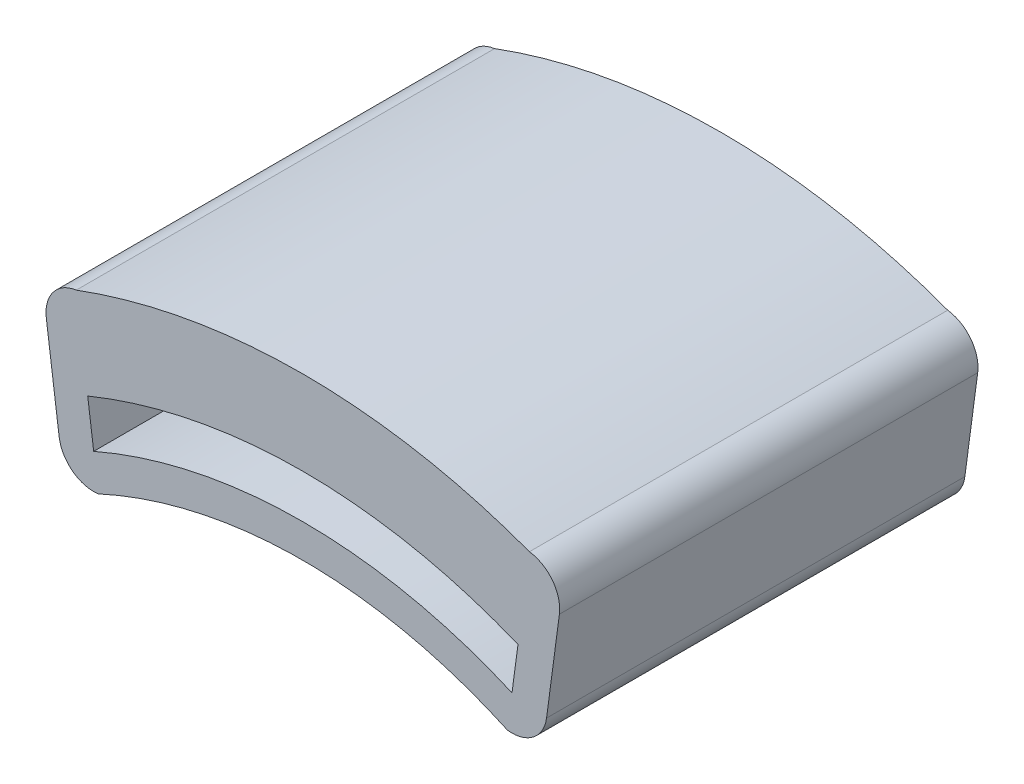
ISO-10303-21;
HEADER;
FILE_DESCRIPTION(('STEP AP214'),'2;1');
FILE_NAME('part.step','',(''),(''),'','','');
FILE_SCHEMA(('AUTOMOTIVE_DESIGN { 1 0 10303 214 1 1 1 1 }'));
ENDSEC;
DATA;
#1=APPLICATION_CONTEXT('core data for automotive mechanical design processes');
#2=APPLICATION_PROTOCOL_DEFINITION('international standard','automotive_design',2000,#1);
#3=PRODUCT_CONTEXT('',#1,'mechanical');
#4=PRODUCT('Part','Part','',(#3));
#5=PRODUCT_RELATED_PRODUCT_CATEGORY('part','',(#4));
#6=PRODUCT_DEFINITION_FORMATION('','',#4);
#7=PRODUCT_DEFINITION_CONTEXT('part definition',#1,'design');
#8=PRODUCT_DEFINITION('design','',#6,#7);
#9=PRODUCT_DEFINITION_SHAPE('','',#8);
#10=(LENGTH_UNIT() NAMED_UNIT(*) SI_UNIT(.MILLI.,.METRE.));
#11=(NAMED_UNIT(*) PLANE_ANGLE_UNIT() SI_UNIT($,.RADIAN.));
#12=(NAMED_UNIT(*) SI_UNIT($,.STERADIAN.) SOLID_ANGLE_UNIT());
#13=UNCERTAINTY_MEASURE_WITH_UNIT(LENGTH_MEASURE(1.E-05),#10,'distance_accuracy_value','');
#14=(GEOMETRIC_REPRESENTATION_CONTEXT(3) GLOBAL_UNCERTAINTY_ASSIGNED_CONTEXT((#13)) GLOBAL_UNIT_ASSIGNED_CONTEXT((#10,
#11,#12)) REPRESENTATION_CONTEXT('',''));
#15=CARTESIAN_POINT('',(0.,0.,0.));
#16=DIRECTION('',(0.,0.,1.));
#17=DIRECTION('',(1.,0.,0.));
#18=AXIS2_PLACEMENT_3D('',#15,#16,#17);
#19=CARTESIAN_POINT('',(-8.19446630907337,-1.09088193411879,0.));
#20=DIRECTION('',(-0.991255034978405,-0.131960053159888,0.));
#21=DIRECTION('',(0.131960053159888,-0.991255034978405,0.));
#22=AXIS2_PLACEMENT_3D('',#19,#20,#21);
#23=PLANE('',#22);
#24=DIRECTION('',(0.,0.,-1.));
#25=VECTOR('',#24,1.);
#26=CARTESIAN_POINT('',(-12.3430961382157,30.0727172606789,24.));
#27=LINE('',#26,#25);
#28=CARTESIAN_POINT('',(-12.3430961382157,30.0727172606789,24.));
#29=VERTEX_POINT('',#28);
#30=CARTESIAN_POINT('',(-12.3430961382157,30.0727172606789,0.));
#31=VERTEX_POINT('',#30);
#32=EDGE_CURVE('E321',#29,#31,#27,.T.);
#33=ORIENTED_EDGE('',*,*,#32,.F.);
#34=DIRECTION('',(-0.131960053159888,0.991255034978405,0.));
#35=VECTOR('',#34,1.);
#36=CARTESIAN_POINT('',(-11.7360798936802,25.5129440997782,24.));
#37=LINE('',#36,#35);
#38=CARTESIAN_POINT('',(-12.,27.495454169735,24.));
#39=VERTEX_POINT('',#38);
#40=EDGE_CURVE('E313',#39,#29,#37,.T.);
#41=ORIENTED_EDGE('',*,*,#40,.F.);
#42=DIRECTION('',(0.,0.,-1.));
#43=VECTOR('',#42,1.);
#44=CARTESIAN_POINT('',(-12.,27.495454169735,24.));
#45=LINE('',#44,#43);
#46=CARTESIAN_POINT('',(-12.,27.495454169735,0.));
#47=VERTEX_POINT('',#46);
#48=EDGE_CURVE('E297',#39,#47,#45,.T.);
#49=ORIENTED_EDGE('',*,*,#48,.T.);
#50=DIRECTION('',(0.131960053159888,-0.991255034978405,0.));
#51=VECTOR('',#50,1.);
#52=CARTESIAN_POINT('',(-13.,35.0072352825947,0.));
#53=LINE('',#52,#51);
#54=EDGE_CURVE('E320',#31,#47,#53,.T.);
#55=ORIENTED_EDGE('',*,*,#54,.F.);
#56=EDGE_LOOP('',(#33,#41,#49,#55));
#57=FACE_BOUND('',#56,.T.);
#58=ADVANCED_FACE('F39',(#57),#23,.F.);
#59=CARTESIAN_POINT('',(0.,0.,24.));
#60=DIRECTION('',(0.,0.,-1.));
#61=DIRECTION('',(-1.,0.,0.));
#62=AXIS2_PLACEMENT_3D('',#59,#60,#61);
#63=CYLINDRICAL_SURFACE('',#62,30.);
#64=CARTESIAN_POINT('',(0.,0.,0.));
#65=DIRECTION('',(0.,0.,1.));
#66=DIRECTION('',(-1.,0.,0.));
#67=AXIS2_PLACEMENT_3D('',#64,#65,#66);
#68=CIRCLE('',#67,30.);
#69=CARTESIAN_POINT('',(12.,27.495454169735,0.));
#70=VERTEX_POINT('',#69);
#71=EDGE_CURVE('E278',#70,#47,#68,.T.);
#72=ORIENTED_EDGE('',*,*,#71,.T.);
#73=ORIENTED_EDGE('',*,*,#48,.F.);
#74=CARTESIAN_POINT('',(0.,0.,24.));
#75=DIRECTION('',(0.,0.,1.));
#76=DIRECTION('',(-1.,0.,0.));
#77=AXIS2_PLACEMENT_3D('',#74,#75,#76);
#78=CIRCLE('',#77,30.);
#79=CARTESIAN_POINT('',(12.,27.495454169735,24.));
#80=VERTEX_POINT('',#79);
#81=EDGE_CURVE('E277',#80,#39,#78,.T.);
#82=ORIENTED_EDGE('',*,*,#81,.F.);
#83=DIRECTION('',(0.,0.,-1.));
#84=VECTOR('',#83,1.);
#85=CARTESIAN_POINT('',(12.,27.495454169735,24.));
#86=LINE('',#85,#84);
#87=EDGE_CURVE('E289',#80,#70,#86,.T.);
#88=ORIENTED_EDGE('',*,*,#87,.T.);
#89=EDGE_LOOP('',(#72,#73,#82,#88));
#90=FACE_BOUND('',#89,.T.);
#91=ADVANCED_FACE('F235',(#90),#63,.T.);
#92=CARTESIAN_POINT('',(0.,0.,24.));
#93=DIRECTION('',(0.,0.,-1.));
#94=DIRECTION('',(-1.,0.,0.));
#95=AXIS2_PLACEMENT_3D('',#92,#93,#94);
#96=CYLINDRICAL_SURFACE('',#95,28.082839740832);
#97=CARTESIAN_POINT('',(0.,0.,0.));
#98=DIRECTION('',(0.,0.,-1.));
#99=DIRECTION('',(-1.,0.,0.));
#100=AXIS2_PLACEMENT_3D('',#97,#98,#99);
#101=CIRCLE('',#100,28.082839740832);
#102=CARTESIAN_POINT('',(-11.7360798936802,25.5129440997782,0.));
#103=VERTEX_POINT('',#102);
#104=CARTESIAN_POINT('',(11.7360798936802,25.5129440997782,0.));
#105=VERTEX_POINT('',#104);
#106=EDGE_CURVE('E271',#103,#105,#101,.T.);
#107=ORIENTED_EDGE('',*,*,#106,.T.);
#108=DIRECTION('',(0.,0.,-1.));
#109=VECTOR('',#108,1.);
#110=CARTESIAN_POINT('',(11.7360798936802,25.5129440997782,24.));
#111=LINE('',#110,#109);
#112=CARTESIAN_POINT('',(11.7360798936802,25.5129440997782,24.));
#113=VERTEX_POINT('',#112);
#114=EDGE_CURVE('E268',#113,#105,#111,.T.);
#115=ORIENTED_EDGE('',*,*,#114,.F.);
#116=CARTESIAN_POINT('',(0.,0.,24.));
#117=DIRECTION('',(0.,0.,-1.));
#118=DIRECTION('',(-1.,0.,0.));
#119=AXIS2_PLACEMENT_3D('',#116,#117,#118);
#120=CIRCLE('',#119,28.082839740832);
#121=CARTESIAN_POINT('',(-11.7360798936802,25.5129440997782,24.));
#122=VERTEX_POINT('',#121);
#123=EDGE_CURVE('E282',#122,#113,#120,.T.);
#124=ORIENTED_EDGE('',*,*,#123,.F.);
#125=DIRECTION('',(0.,0.,-1.));
#126=VECTOR('',#125,1.);
#127=CARTESIAN_POINT('',(-11.7360798936802,25.5129440997782,24.));
#128=LINE('',#127,#126);
#129=EDGE_CURVE('E275',#122,#103,#128,.T.);
#130=ORIENTED_EDGE('',*,*,#129,.T.);
#131=EDGE_LOOP('',(#107,#115,#124,#130));
#132=FACE_BOUND('',#131,.T.);
#133=ADVANCED_FACE('F241',(#132),#96,.F.);
#134=CARTESIAN_POINT('',(0.,0.,24.));
#135=DIRECTION('',(0.,0.,-1.));
#136=DIRECTION('',(-1.,0.,0.));
#137=AXIS2_PLACEMENT_3D('',#134,#135,#136);
#138=PLANE('',#137);
#139=DIRECTION('',(-0.131960053159888,-0.991255034978405,0.));
#140=VECTOR('',#139,1.);
#141=CARTESIAN_POINT('',(13.,35.0072352825947,24.));
#142=LINE('',#141,#140);
#143=CARTESIAN_POINT('',(12.3430961382157,30.0727172606789,24.));
#144=VERTEX_POINT('',#143);
#145=EDGE_CURVE('E195',#144,#80,#142,.T.);
#146=ORIENTED_EDGE('',*,*,#145,.T.);
#147=ORIENTED_EDGE('',*,*,#81,.T.);
#148=ORIENTED_EDGE('',*,*,#40,.T.);
#149=CARTESIAN_POINT('',(0.,0.,24.));
#150=DIRECTION('',(0.,0.,-1.));
#151=DIRECTION('',(-1.,0.,0.));
#152=AXIS2_PLACEMENT_3D('',#149,#150,#151);
#153=CIRCLE('',#152,32.5072352825947);
#154=EDGE_CURVE('E152',#29,#144,#153,.T.);
#155=ORIENTED_EDGE('',*,*,#154,.T.);
#156=EDGE_LOOP('',(#146,#147,#148,#155));
#157=FACE_BOUND('',#156,.T.);
#158=CARTESIAN_POINT('',(0.,0.,24.));
#159=DIRECTION('',(0.,0.,1.));
#160=DIRECTION('',(-1.,0.,0.));
#161=AXIS2_PLACEMENT_3D('',#158,#159,#160);
#162=CIRCLE('',#161,37.343092026919);
#163=CARTESIAN_POINT('',(13.,35.0072352825947,24.));
#164=VERTEX_POINT('',#163);
#165=CARTESIAN_POINT('',(-13.,35.0072352825947,24.));
#166=VERTEX_POINT('',#165);
#167=EDGE_CURVE('E149',#164,#166,#162,.T.);
#168=ORIENTED_EDGE('',*,*,#167,.T.);
#169=CARTESIAN_POINT('',(-12.7360798936802,33.0247252126379,24.));
#170=DIRECTION('',(0.,0.,-1.));
#171=DIRECTION('',(-1.,0.,0.));
#172=AXIS2_PLACEMENT_3D('',#169,#170,#171);
#173=CIRCLE('',#172,2.);
#174=CARTESIAN_POINT('',(-14.718589963637,32.7608051063181,24.));
#175=VERTEX_POINT('',#174);
#176=EDGE_CURVE('E178',#166,#175,#173,.F.);
#177=ORIENTED_EDGE('',*,*,#176,.T.);
#178=DIRECTION('',(-0.131960053159888,0.991255034978405,0.));
#179=VECTOR('',#178,1.);
#180=CARTESIAN_POINT('',(-13.718589963637,25.2490239934585,24.));
#181=LINE('',#180,#179);
#182=CARTESIAN_POINT('',(-13.9825100699568,27.2315340634153,24.));
#183=VERTEX_POINT('',#182);
#184=EDGE_CURVE('E285',#183,#175,#181,.T.);
#185=ORIENTED_EDGE('',*,*,#184,.F.);
#186=CARTESIAN_POINT('',(-12.,27.495454169735,24.));
#187=DIRECTION('',(0.,0.,-1.));
#188=DIRECTION('',(-1.,0.,0.));
#189=AXIS2_PLACEMENT_3D('',#186,#187,#188);
#190=CIRCLE('',#189,2.);
#191=EDGE_CURVE('E175',#183,#122,#190,.F.);
#192=ORIENTED_EDGE('',*,*,#191,.T.);
#193=ORIENTED_EDGE('',*,*,#123,.T.);
#194=CARTESIAN_POINT('',(12.,27.4954541697351,24.));
#195=DIRECTION('',(0.,0.,-1.));
#196=DIRECTION('',(-1.,0.,0.));
#197=AXIS2_PLACEMENT_3D('',#194,#195,#196);
#198=CIRCLE('',#197,2.);
#199=CARTESIAN_POINT('',(13.9825100699568,27.2315340634153,24.));
#200=VERTEX_POINT('',#199);
#201=EDGE_CURVE('E55',#113,#200,#198,.F.);
#202=ORIENTED_EDGE('',*,*,#201,.T.);
#203=DIRECTION('',(-0.131960053159888,-0.991255034978405,0.));
#204=VECTOR('',#203,1.);
#205=CARTESIAN_POINT('',(14.9825100699568,34.7433151762749,24.));
#206=LINE('',#205,#204);
#207=CARTESIAN_POINT('',(14.718589963637,32.7608051063181,24.));
#208=VERTEX_POINT('',#207);
#209=EDGE_CURVE('E183',#208,#200,#206,.T.);
#210=ORIENTED_EDGE('',*,*,#209,.F.);
#211=CARTESIAN_POINT('',(12.7360798936802,33.0247252126379,24.));
#212=DIRECTION('',(0.,0.,-1.));
#213=DIRECTION('',(-1.,0.,0.));
#214=AXIS2_PLACEMENT_3D('',#211,#212,#213);
#215=CIRCLE('',#214,2.);
#216=EDGE_CURVE('E63',#208,#164,#215,.F.);
#217=ORIENTED_EDGE('',*,*,#216,.T.);
#218=EDGE_LOOP('',(#168,#177,#185,#192,#193,#202,#210,#217));
#219=FACE_BOUND('',#218,.T.);
#220=ADVANCED_FACE('F186',(#157,#219),#138,.F.);
#221=CARTESIAN_POINT('',(0.,0.,0.));
#222=DIRECTION('',(0.,0.,-1.));
#223=DIRECTION('',(-1.,0.,0.));
#224=AXIS2_PLACEMENT_3D('',#221,#222,#223);
#225=PLANE('',#224);
#226=ORIENTED_EDGE('',*,*,#71,.F.);
#227=DIRECTION('',(0.131960053159888,0.991255034978405,0.));
#228=VECTOR('',#227,1.);
#229=CARTESIAN_POINT('',(11.7360798936802,25.5129440997782,0.));
#230=LINE('',#229,#228);
#231=CARTESIAN_POINT('',(12.3430961382157,30.0727172606789,0.));
#232=VERTEX_POINT('',#231);
#233=EDGE_CURVE('E188',#70,#232,#230,.T.);
#234=ORIENTED_EDGE('',*,*,#233,.T.);
#235=CARTESIAN_POINT('',(0.,0.,0.));
#236=DIRECTION('',(0.,0.,-1.));
#237=DIRECTION('',(-1.,0.,0.));
#238=AXIS2_PLACEMENT_3D('',#235,#236,#237);
#239=CIRCLE('',#238,32.5072352825947);
#240=EDGE_CURVE('E143',#31,#232,#239,.T.);
#241=ORIENTED_EDGE('',*,*,#240,.F.);
#242=ORIENTED_EDGE('',*,*,#54,.T.);
#243=EDGE_LOOP('',(#226,#234,#241,#242));
#244=FACE_BOUND('',#243,.T.);
#245=DIRECTION('',(0.131960053159888,-0.991255034978405,0.));
#246=VECTOR('',#245,1.);
#247=CARTESIAN_POINT('',(-14.9825100699568,34.7433151762749,0.));
#248=LINE('',#247,#246);
#249=CARTESIAN_POINT('',(-14.718589963637,32.7608051063181,0.));
#250=VERTEX_POINT('',#249);
#251=CARTESIAN_POINT('',(-13.9825100699568,27.2315340634153,0.));
#252=VERTEX_POINT('',#251);
#253=EDGE_CURVE('E308',#250,#252,#248,.T.);
#254=ORIENTED_EDGE('',*,*,#253,.F.);
#255=CARTESIAN_POINT('',(-12.7360798936802,33.0247252126379,0.));
#256=DIRECTION('',(0.,0.,-1.));
#257=DIRECTION('',(-1.,0.,0.));
#258=AXIS2_PLACEMENT_3D('',#255,#256,#257);
#259=CIRCLE('',#258,2.);
#260=CARTESIAN_POINT('',(-13.,35.0072352825947,0.));
#261=VERTEX_POINT('',#260);
#262=EDGE_CURVE('E138',#250,#261,#259,.T.);
#263=ORIENTED_EDGE('',*,*,#262,.T.);
#264=CARTESIAN_POINT('',(0.,0.,0.));
#265=DIRECTION('',(0.,0.,1.));
#266=DIRECTION('',(-1.,0.,0.));
#267=AXIS2_PLACEMENT_3D('',#264,#265,#266);
#268=CIRCLE('',#267,37.343092026919);
#269=CARTESIAN_POINT('',(13.,35.0072352825947,0.));
#270=VERTEX_POINT('',#269);
#271=EDGE_CURVE('E130',#270,#261,#268,.T.);
#272=ORIENTED_EDGE('',*,*,#271,.F.);
#273=CARTESIAN_POINT('',(12.7360798936802,33.0247252126379,0.));
#274=DIRECTION('',(0.,0.,-1.));
#275=DIRECTION('',(-1.,0.,0.));
#276=AXIS2_PLACEMENT_3D('',#273,#274,#275);
#277=CIRCLE('',#276,2.);
#278=CARTESIAN_POINT('',(14.718589963637,32.7608051063181,0.));
#279=VERTEX_POINT('',#278);
#280=EDGE_CURVE('E136',#270,#279,#277,.T.);
#281=ORIENTED_EDGE('',*,*,#280,.T.);
#282=DIRECTION('',(0.131960053159888,0.991255034978405,0.));
#283=VECTOR('',#282,1.);
#284=CARTESIAN_POINT('',(13.718589963637,25.2490239934585,0.));
#285=LINE('',#284,#283);
#286=CARTESIAN_POINT('',(13.9825100699568,27.2315340634153,0.));
#287=VERTEX_POINT('',#286);
#288=EDGE_CURVE('E185',#287,#279,#285,.T.);
#289=ORIENTED_EDGE('',*,*,#288,.F.);
#290=CARTESIAN_POINT('',(12.,27.4954541697351,0.));
#291=DIRECTION('',(0.,0.,-1.));
#292=DIRECTION('',(-1.,0.,0.));
#293=AXIS2_PLACEMENT_3D('',#290,#291,#292);
#294=CIRCLE('',#293,2.);
#295=EDGE_CURVE('E155',#287,#105,#294,.T.);
#296=ORIENTED_EDGE('',*,*,#295,.T.);
#297=ORIENTED_EDGE('',*,*,#106,.F.);
#298=CARTESIAN_POINT('',(-12.,27.495454169735,0.));
#299=DIRECTION('',(0.,0.,-1.));
#300=DIRECTION('',(-1.,0.,0.));
#301=AXIS2_PLACEMENT_3D('',#298,#299,#300);
#302=CIRCLE('',#301,2.);
#303=EDGE_CURVE('E160',#103,#252,#302,.T.);
#304=ORIENTED_EDGE('',*,*,#303,.T.);
#305=EDGE_LOOP('',(#254,#263,#272,#281,#289,#296,#297,#304));
#306=FACE_BOUND('',#305,.T.);
#307=ADVANCED_FACE('F133',(#244,#306),#225,.T.);
#308=CARTESIAN_POINT('',(-10.1769763790302,-1.35480204043857,0.));
#309=DIRECTION('',(-0.991255034978405,-0.131960053159888,0.));
#310=DIRECTION('',(0.131960053159888,-0.991255034978405,0.));
#311=AXIS2_PLACEMENT_3D('',#308,#309,#310);
#312=PLANE('',#311);
#313=ORIENTED_EDGE('',*,*,#184,.T.);
#314=DIRECTION('',(0.,0.,-1.));
#315=VECTOR('',#314,1.);
#316=CARTESIAN_POINT('',(-14.718589963637,32.7608051063181,0.));
#317=LINE('',#316,#315);
#318=EDGE_CURVE('E156',#175,#250,#317,.T.);
#319=ORIENTED_EDGE('',*,*,#318,.T.);
#320=ORIENTED_EDGE('',*,*,#253,.T.);
#321=DIRECTION('',(0.,0.,1.));
#322=VECTOR('',#321,1.);
#323=CARTESIAN_POINT('',(-13.9825100699568,27.2315340634153,24.));
#324=LINE('',#323,#322);
#325=EDGE_CURVE('E163',#252,#183,#324,.T.);
#326=ORIENTED_EDGE('',*,*,#325,.T.);
#327=EDGE_LOOP('',(#313,#319,#320,#326));
#328=FACE_BOUND('',#327,.T.);
#329=ADVANCED_FACE('F247',(#328),#312,.T.);
#330=CARTESIAN_POINT('',(0.,0.,24.));
#331=DIRECTION('',(0.,0.,-1.));
#332=DIRECTION('',(-1.,0.,0.));
#333=AXIS2_PLACEMENT_3D('',#330,#331,#332);
#334=CYLINDRICAL_SURFACE('',#333,37.343092026919);
#335=ORIENTED_EDGE('',*,*,#271,.T.);
#336=DIRECTION('',(0.,0.,-1.));
#337=VECTOR('',#336,1.);
#338=CARTESIAN_POINT('',(-13.,35.0072352825947,24.));
#339=LINE('',#338,#337);
#340=EDGE_CURVE('E317',#166,#261,#339,.T.);
#341=ORIENTED_EDGE('',*,*,#340,.F.);
#342=ORIENTED_EDGE('',*,*,#167,.F.);
#343=DIRECTION('',(0.,0.,-1.));
#344=VECTOR('',#343,1.);
#345=CARTESIAN_POINT('',(13.,35.0072352825947,24.));
#346=LINE('',#345,#344);
#347=EDGE_CURVE('E147',#164,#270,#346,.T.);
#348=ORIENTED_EDGE('',*,*,#347,.T.);
#349=EDGE_LOOP('',(#335,#341,#342,#348));
#350=FACE_BOUND('',#349,.T.);
#351=ADVANCED_FACE('F148',(#350),#334,.T.);
#352=CARTESIAN_POINT('',(0.,0.,24.));
#353=DIRECTION('',(0.,0.,-1.));
#354=DIRECTION('',(-1.,0.,0.));
#355=AXIS2_PLACEMENT_3D('',#352,#353,#354);
#356=CYLINDRICAL_SURFACE('',#355,32.5072352825947);
#357=CARTESIAN_POINT('',(0.,32.5072352825947,22.));
#358=CARTESIAN_POINT('',(-0.27397744995883,32.5072350180725,21.9999995969007));
#359=CARTESIAN_POINT('',(-0.547961887279076,32.5037633996525,21.9887312299823));
#360=CARTESIAN_POINT('',(-1.09391315629798,32.4899719077899,21.9437609960717));
#361=CARTESIAN_POINT('',(-1.36587991924894,32.4796518020744,21.9100583682003));
#362=CARTESIAN_POINT('',(-1.90586900600679,32.4524438200971,21.8205183840396));
#363=CARTESIAN_POINT('',(-2.17389046175007,32.4355545202239,21.7646762298385));
#364=CARTESIAN_POINT('',(-2.70402423656154,32.3956673645125,21.6313529564662));
#365=CARTESIAN_POINT('',(-2.96613658053511,32.3726695344252,21.5538719285158));
#366=CARTESIAN_POINT('',(-3.4822101009548,32.3212266855569,21.3780805669376));
#367=CARTESIAN_POINT('',(-3.73618464966118,32.2927912013809,21.279806660757));
#368=CARTESIAN_POINT('',(-4.23488920395653,32.2311839125901,21.0630933725675));
#369=CARTESIAN_POINT('',(-4.47961575158893,32.1980103580766,20.9446465370211));
#370=CARTESIAN_POINT('',(-4.95816554000693,32.1277983596085,20.6885121219913));
#371=CARTESIAN_POINT('',(-5.19198985786533,32.0907602986189,20.5508264485806));
#372=CARTESIAN_POINT('',(-5.64735808003023,32.0137630921472,20.2571638025444));
#373=CARTESIAN_POINT('',(-5.86890131002041,31.9738037865474,20.1011858270076));
#374=CARTESIAN_POINT('',(-6.30420229962093,31.8908731998445,19.7675129844213));
#375=CARTESIAN_POINT('',(-6.51758746084267,31.8478496875291,19.5893448736591));
#376=CARTESIAN_POINT('',(-6.92870118770224,31.7609445507939,19.2159690905943));
#377=CARTESIAN_POINT('',(-7.126429523447,31.7170629137858,19.0207611681805));
#378=CARTESIAN_POINT('',(-7.50503430732088,31.6296153657719,18.6144970314819));
#379=CARTESIAN_POINT('',(-7.68590757159231,31.5860495158446,18.4034378364962));
#380=CARTESIAN_POINT('',(-8.02959161596786,31.5004345212629,17.9668121725298));
#381=CARTESIAN_POINT('',(-8.19240286559572,31.4583853372018,17.741246080898));
#382=CARTESIAN_POINT('',(-8.50256654818438,31.375995333507,17.2713848945545));
#383=CARTESIAN_POINT('',(-8.64945148961618,31.3357201676075,17.0267693166972));
#384=CARTESIAN_POINT('',(-8.92195911330177,31.259223017118,16.5254832677826));
#385=CARTESIAN_POINT('',(-9.04759010508046,31.222999450385,16.2688175582627));
#386=CARTESIAN_POINT('',(-9.27663500257236,31.1557161269344,15.7450937342347));
#387=CARTESIAN_POINT('',(-9.38004874100772,31.1246564090967,15.4780355414975));
#388=CARTESIAN_POINT('',(-9.56374198950005,31.0687047770751,14.9354496856926));
#389=CARTESIAN_POINT('',(-9.64402237057474,31.0438126306746,14.659922341938));
#390=CARTESIAN_POINT('',(-9.77869255700877,31.0016507968128,14.1106347842155));
#391=CARTESIAN_POINT('',(-9.83377151794006,30.9841792917825,13.8370589791854));
#392=CARTESIAN_POINT('',(-9.92090154283603,30.9563912184857,13.2859031182593));
#393=CARTESIAN_POINT('',(-9.95295301944206,30.9460745220087,13.008323134207));
#394=CARTESIAN_POINT('',(-9.99371051469418,30.9329364326511,12.4513391073177));
#395=CARTESIAN_POINT('',(-10.0024217245029,30.9301133730948,12.1719354839408));
#396=CARTESIAN_POINT('',(-9.99642632282075,30.9320516363852,11.6134094898792));
#397=CARTESIAN_POINT('',(-9.98172024916009,30.9368127850436,11.3342871128824));
#398=CARTESIAN_POINT('',(-9.93004724324291,30.9534360456238,10.7891126303869));
#399=CARTESIAN_POINT('',(-9.89395275959056,30.9650197538618,10.5229687675618));
#400=CARTESIAN_POINT('',(-9.8005668707572,30.9947032878417,9.99480543131999));
#401=CARTESIAN_POINT('',(-9.74327608572013,31.0128029229455,9.73278583747272));
#402=CARTESIAN_POINT('',(-9.60799875924452,31.0549789348614,9.21467402169991));
#403=CARTESIAN_POINT('',(-9.53001443166504,31.0790546723138,8.95858116889781));
#404=CARTESIAN_POINT('',(-9.35395084711621,31.1324976168412,8.45386576773879));
#405=CARTESIAN_POINT('',(-9.25586398927233,31.161866824898,8.20524608592005));
#406=CARTESIAN_POINT('',(-9.03886666102879,31.2255054191794,7.71373639387521));
#407=CARTESIAN_POINT('',(-8.91968619623307,31.2598371300662,7.47097371115236));
#408=CARTESIAN_POINT('',(-8.6622858143179,31.3321403358639,6.99622710752354));
#409=CARTESIAN_POINT('',(-8.52405937394578,31.3701130764678,6.76424691618621));
#410=CARTESIAN_POINT('',(-8.22953319477405,31.4486621341391,6.31251473422599));
#411=CARTESIAN_POINT('',(-8.07323273749678,31.4892385546793,6.09276323023213));
#412=CARTESIAN_POINT('',(-7.74355944346192,31.5719259444184,5.66676761598674));
#413=CARTESIAN_POINT('',(-7.57018609648898,31.614036959454,5.46052390971632));
#414=CARTESIAN_POINT('',(-7.19938560649112,31.7005837970392,5.05393223039627));
#415=CARTESIAN_POINT('',(-7.00123351605941,31.7450400294341,4.85424910023052));
#416=CARTESIAN_POINT('',(-6.5887956820222,31.8331990880538,4.47226779581909));
#417=CARTESIAN_POINT('',(-6.37451514041252,31.8769021516606,4.28996405873889));
#418=CARTESIAN_POINT('',(-5.931013129865,31.9623910530744,3.94380703251064));
#419=CARTESIAN_POINT('',(-5.70178499951618,32.0041760217492,3.77996205948677));
#420=CARTESIAN_POINT('',(-5.23002697485567,32.0846441409514,3.4720384489165));
#421=CARTESIAN_POINT('',(-4.98750236265044,32.1233285083894,3.32795204067289));
#422=CARTESIAN_POINT('',(-4.488760575479,32.196822510178,3.05953975476768));
#423=CARTESIAN_POINT('',(-4.23245335892769,32.2316004682447,2.93537234958215));
#424=CARTESIAN_POINT('',(-3.70961784949692,32.2959509171305,2.70915149423311));
#425=CARTESIAN_POINT('',(-3.44308945349515,32.3255233554138,2.60709826725048));
#426=CARTESIAN_POINT('',(-2.90179731204585,32.3786016669048,2.42602502772172));
#427=CARTESIAN_POINT('',(-2.62703554855457,32.4021089872349,2.34699952023513));
#428=CARTESIAN_POINT('',(-2.07128666652377,32.4423753675399,2.21268750996012));
#429=CARTESIAN_POINT('',(-1.79029978856965,32.4591346878303,2.15740009143007));
#430=CARTESIAN_POINT('',(-1.23492655978379,32.4849143150488,2.07272078025122));
#431=CARTESIAN_POINT('',(-0.960688735577882,32.494201673545,2.04243418986602));
#432=CARTESIAN_POINT('',(-0.41050348330445,32.5058076708483,2.00462537772779));
#433=CARTESIAN_POINT('',(-0.134556098257496,32.5081264843088,1.99710258544369));
#434=CARTESIAN_POINT('',(0.416948833734831,32.505730786395,2.00489115534064));
#435=CARTESIAN_POINT('',(0.692506425799943,32.5010171695586,2.02019961334493));
#436=CARTESIAN_POINT('',(1.24120976951545,32.4846899093669,2.07350134147842));
#437=CARTESIAN_POINT('',(1.51435553970158,32.4730763190873,2.11149443711367));
#438=CARTESIAN_POINT('',(2.0496670546716,32.4436331494726,2.20862276300325));
#439=CARTESIAN_POINT('',(2.31193856964161,32.4259607419402,2.26722429493803));
#440=CARTESIAN_POINT('',(2.83058486306329,32.3848086997791,2.40521888187112));
#441=CARTESIAN_POINT('',(3.08695749553726,32.3613269871593,2.48461937726733));
#442=CARTESIAN_POINT('',(3.59195247136743,32.3091728142476,2.66353292388505));
#443=CARTESIAN_POINT('',(3.84057699354874,32.2805018289415,2.76304026092202));
#444=CARTESIAN_POINT('',(4.3286802282,32.2186812614955,2.98146093848693));
#445=CARTESIAN_POINT('',(4.56815538861795,32.1855299621794,3.10038172328587));
#446=CARTESIAN_POINT('',(5.04191491677247,32.1147652366554,3.35976115113182));
#447=CARTESIAN_POINT('',(5.27594538113561,32.0770653166445,3.50065993928643));
#448=CARTESIAN_POINT('',(5.73147625747664,31.9988119833426,3.80093687691972));
#449=CARTESIAN_POINT('',(5.95297098566036,31.9582572940832,3.96032331052434));
#450=CARTESIAN_POINT('',(6.38199984111779,31.8753535828795,4.29647197431158));
#451=CARTESIAN_POINT('',(6.58953383298848,31.8330045435386,4.47323437298008));
#452=CARTESIAN_POINT('',(6.9894116190885,31.747602745842,4.84302494524222));
#453=CARTESIAN_POINT('',(7.1817550984352,31.7045499729211,5.03605345584313));
#454=CARTESIAN_POINT('',(7.5572045445547,31.6172038338502,5.44495329154905));
#455=CARTESIAN_POINT('',(7.73966814744127,31.5729266595741,5.66141848440263));
#456=CARTESIAN_POINT('',(8.08567587718123,31.48609227804,6.1091707974974));
#457=CARTESIAN_POINT('',(8.24922685331866,31.4435344517691,6.34045250442463));
#458=CARTESIAN_POINT('',(8.55639535003831,31.3613415157725,6.81652843406243));
#459=CARTESIAN_POINT('',(8.70000484781821,31.3217075853693,7.06132804021863));
#460=CARTESIAN_POINT('',(8.96606986159293,31.2465846019324,7.56264911541091));
#461=CARTESIAN_POINT('',(9.08853413134298,31.2110938356815,7.81916567794801));
#462=CARTESIAN_POINT('',(9.31093493081572,31.1454689402774,8.34122083929368));
#463=CARTESIAN_POINT('',(9.41095992678767,31.1153138783404,8.60671908388138));
#464=CARTESIAN_POINT('',(9.58823446162039,31.0611446527316,9.14583242961715));
#465=CARTESIAN_POINT('',(9.6654839741066,31.0371304961711,9.41944754016436));
#466=CARTESIAN_POINT('',(9.7964658496504,30.9960371798768,9.972677779878));
#467=CARTESIAN_POINT('',(9.85020541114554,30.9789558975041,10.2522910449422));
#468=CARTESIAN_POINT('',(9.93367032999031,30.9522934322052,10.8154298653373));
#469=CARTESIAN_POINT('',(9.96339666442312,30.9427119441175,11.0989552610084));
#470=CARTESIAN_POINT('',(9.99776508812133,30.9316236547947,11.6551808162468));
#471=CARTESIAN_POINT('',(10.0034501814278,30.9297811317636,11.9278103569876));
#472=CARTESIAN_POINT('',(9.99254178356689,30.9333071213415,12.4725711313101));
#473=CARTESIAN_POINT('',(9.97594897663189,30.9386754124813,12.7447023799391));
#474=CARTESIAN_POINT('',(9.92064341935737,30.9564535873053,13.2864576402734));
#475=CARTESIAN_POINT('',(9.88193175095954,30.9688631265674,13.5560817739584));
#476=CARTESIAN_POINT('',(9.78274549985666,31.0003377033422,14.0908989802067));
#477=CARTESIAN_POINT('',(9.72227082106255,31.0194027702405,14.3560920332003));
#478=CARTESIAN_POINT('',(9.58108778898903,31.0632979652809,14.8765326078324));
#479=CARTESIAN_POINT('',(9.50067410748342,31.088043775859,15.1318673369248));
#480=CARTESIAN_POINT('',(9.31982733680036,31.142737259441,15.6348693504586));
#481=CARTESIAN_POINT('',(9.21938709691607,31.1726867899988,15.8825338595641));
#482=CARTESIAN_POINT('',(8.99927233061051,31.2369425290935,16.3685538666246));
#483=CARTESIAN_POINT('',(8.8795987418669,31.2712485252239,16.6069098176932));
#484=CARTESIAN_POINT('',(8.62185281300239,31.3432911309305,17.0729245545161));
#485=CARTESIAN_POINT('',(8.48377934160923,31.3810279513971,17.3005826813757));
#486=CARTESIAN_POINT('',(8.18455316064591,31.4604241903264,17.7523261574449));
#487=CARTESIAN_POINT('',(8.02272205127987,31.5021782397031,17.97594572918));
#488=CARTESIAN_POINT('',(7.68129157454202,31.5871658598604,18.4088819256651));
#489=CARTESIAN_POINT('',(7.50169181099137,31.6303994636158,18.6181982313263));
#490=CARTESIAN_POINT('',(7.12581213493906,31.7171933176559,19.0213079296744));
#491=CARTESIAN_POINT('',(6.92952792156879,31.7607536495089,19.2150972947104));
#492=CARTESIAN_POINT('',(6.5215289496786,31.8470324456141,19.5858847350889));
#493=CARTESIAN_POINT('',(6.30981444751214,31.8897509238374,19.762883089279));
#494=CARTESIAN_POINT('',(5.86532223284273,31.9745386142698,20.1042566105523));
#495=CARTESIAN_POINT('',(5.63209065804269,32.0165447943648,20.2680571487426));
#496=CARTESIAN_POINT('',(5.15217469443143,32.0972680987723,20.5753279272718));
#497=CARTESIAN_POINT('',(4.90549511976739,32.1359863875609,20.7188053775897));
#498=CARTESIAN_POINT('',(4.40030120789909,32.209048679334,20.9843625512673));
#499=CARTESIAN_POINT('',(4.14178879623016,32.2433933906067,21.1064457405727));
#500=CARTESIAN_POINT('',(3.61470670984883,32.3067279132386,21.3282166503388));
#501=CARTESIAN_POINT('',(3.34613791176877,32.3357181900521,21.4279063176031));
#502=CARTESIAN_POINT('',(2.82640612124731,32.3850801234232,21.5957740632068));
#503=CARTESIAN_POINT('',(2.5759636197935,32.406004184453,21.6660269781131));
#504=CARTESIAN_POINT('',(2.06998933043209,32.442253340783,21.7868679526125));
#505=CARTESIAN_POINT('',(1.81445791548015,32.4575788448088,21.8374574477609));
#506=CARTESIAN_POINT('',(1.29998241292798,32.482252109083,21.9185609123008));
#507=CARTESIAN_POINT('',(1.04103886691335,32.4916008066001,21.9490780294164));
#508=CARTESIAN_POINT('',(0.521399046249018,32.5040926710438,21.989798262087));
#509=CARTESIAN_POINT('',(0.260702686455137,32.5072355343003,22.0000003835683));
#510=CARTESIAN_POINT('',(0.,32.5072352825947,22.));
#511=B_SPLINE_CURVE_WITH_KNOTS('',3,(#357,#358,#359,#360,#361,#362,#363,#364,#365,#366,#367,
#368,#369,#370,#371,#372,#373,#374,#375,#376,#377,#378,#379,#380,#381,#382,#383,#384,#385,#386,
#387,#388,#389,#390,#391,#392,#393,#394,#395,#396,#397,#398,#399,#400,#401,#402,#403,#404,#405,
#406,#407,#408,#409,#410,#411,#412,#413,#414,#415,#416,#417,#418,#419,#420,#421,#422,#423,#424,
#425,#426,#427,#428,#429,#430,#431,#432,#433,#434,#435,#436,#437,#438,#439,#440,#441,#442,#443,
#444,#445,#446,#447,#448,#449,#450,#451,#452,#453,#454,#455,#456,#457,#458,#459,#460,#461,#462,
#463,#464,#465,#466,#467,#468,#469,#470,#471,#472,#473,#474,#475,#476,#477,#478,#479,#480,#481,
#482,#483,#484,#485,#486,#487,#488,#489,#490,#491,#492,#493,#494,#495,#496,#497,#498,#499,#500,
#501,#502,#503,#504,#505,#506,#507,#508,#509,#510),.UNSPECIFIED.,.T.,.F.,(4,2,2,2,2,2,2,2,2,2,2,
2,2,2,2,2,2,2,2,2,2,2,2,2,2,2,2,2,2,2,2,2,2,2,2,2,2,2,2,2,2,2,2,2,2,2,2,2,2,2,2,2,2,2,2,2,2,2,2,
2,2,2,2,2,2,2,2,2,2,2,2,2,2,2,2,2,4),(0.,0.821691912132715,1.64341169414782,2.46530965052819,
3.28720414217287,4.10767049005699,4.92844064590756,5.74912954218507,6.56986345539444,
7.41279397317529,8.25573686562111,9.09883866530979,9.9419185433512,10.805330088811,
11.6684032875819,12.5314829843648,13.3945301802031,14.2323112086736,15.0700772241392,
15.9076568946571,16.7452173285648,17.5507606003158,18.3562803060086,19.1617138694365,
19.9674525353271,20.7843686007464,21.6015651588996,22.4187942133953,23.2360476978164,
24.0894686632834,24.9426155402089,25.7961452564353,26.6493383257282,27.5090144967704,
28.3686993434394,29.2281788813403,30.0876252602147,30.9147885123911,31.7419310331307,
32.5689683488036,33.3959993028513,34.2030230036603,35.0103357956578,35.8174194784488,
36.6248133752633,37.4511648029058,38.2778879511513,39.1046191165013,39.9313674145836,
40.7900011358915,41.6483229191702,42.5069890258379,43.3652988029738,44.2201628040059,
45.0750277949869,45.9296308540515,46.7841991381011,47.6012863010883,48.4183483690433,
49.2353704739178,50.0523961861906,50.8580004078362,51.6638927962744,52.469745907196,
53.2756485869246,54.1122247046103,54.9488194792223,55.7856305666102,56.622427754678,
57.4856323207726,58.3485298784573,59.2112875142082,60.0739701161959,60.8559908896586,
61.6379545598694,62.4197955743005,63.2016748456188),.UNSPECIFIED.);
#512=CARTESIAN_POINT('',(0.,32.5072352825947,22.));
#513=VERTEX_POINT('',#512);
#514=EDGE_CURVE('E144',#513,#513,#511,.T.);
#515=ORIENTED_EDGE('',*,*,#514,.F.);
#516=EDGE_LOOP('',(#515));
#517=FACE_BOUND('',#516,.T.);
#518=ORIENTED_EDGE('',*,*,#240,.T.);
#519=DIRECTION('',(0.,0.,-1.));
#520=VECTOR('',#519,1.);
#521=CARTESIAN_POINT('',(12.3430961382157,30.0727172606789,24.));
#522=LINE('',#521,#520);
#523=EDGE_CURVE('E151',#144,#232,#522,.T.);
#524=ORIENTED_EDGE('',*,*,#523,.F.);
#525=ORIENTED_EDGE('',*,*,#154,.F.);
#526=ORIENTED_EDGE('',*,*,#32,.T.);
#527=EDGE_LOOP('',(#518,#524,#525,#526));
#528=FACE_BOUND('',#527,.T.);
#529=ADVANCED_FACE('F341',(#517,#528),#356,.F.);
#530=CARTESIAN_POINT('',(0.,25.5119440997782,12.));
#531=DIRECTION('',(0.,1.,0.));
#532=DIRECTION('',(0.,0.,1.));
#533=AXIS2_PLACEMENT_3D('',#530,#531,#532);
#534=CYLINDRICAL_SURFACE('',#533,10.);
#535=ORIENTED_EDGE('',*,*,#514,.T.);
#536=EDGE_LOOP('',(#535));
#537=FACE_BOUND('',#536,.T.);
#538=CARTESIAN_POINT('',(0.,35.01,12.));
#539=DIRECTION('',(0.,1.,0.));
#540=DIRECTION('',(0.,0.,1.));
#541=AXIS2_PLACEMENT_3D('',#538,#539,#540);
#542=CIRCLE('',#541,10.);
#543=CARTESIAN_POINT('',(0.,35.01,22.));
#544=VERTEX_POINT('',#543);
#545=EDGE_CURVE('E192',#544,#544,#542,.T.);
#546=ORIENTED_EDGE('',*,*,#545,.T.);
#547=EDGE_LOOP('',(#546));
#548=FACE_BOUND('',#547,.T.);
#549=ADVANCED_FACE('F213',(#537,#548),#534,.F.);
#550=CARTESIAN_POINT('',(0.,35.01,12.));
#551=DIRECTION('',(0.,1.,0.));
#552=DIRECTION('',(0.,0.,1.));
#553=AXIS2_PLACEMENT_3D('',#550,#551,#552);
#554=PLANE('',#553);
#555=ORIENTED_EDGE('',*,*,#545,.F.);
#556=EDGE_LOOP('',(#555));
#557=FACE_BOUND('',#556,.T.);
#558=ADVANCED_FACE('F218',(#557),#554,.F.);
#559=CARTESIAN_POINT('',(8.19446630907337,-1.09088193411879,0.));
#560=DIRECTION('',(0.991255034978405,-0.131960053159888,0.));
#561=DIRECTION('',(0.131960053159888,0.991255034978405,0.));
#562=AXIS2_PLACEMENT_3D('',#559,#560,#561);
#563=PLANE('',#562);
#564=ORIENTED_EDGE('',*,*,#233,.F.);
#565=ORIENTED_EDGE('',*,*,#87,.F.);
#566=ORIENTED_EDGE('',*,*,#145,.F.);
#567=ORIENTED_EDGE('',*,*,#523,.T.);
#568=EDGE_LOOP('',(#564,#565,#566,#567));
#569=FACE_BOUND('',#568,.T.);
#570=ADVANCED_FACE('F221',(#569),#563,.F.);
#571=CARTESIAN_POINT('',(10.1769763790302,-1.35480204043857,0.));
#572=DIRECTION('',(0.991255034978405,-0.131960053159888,0.));
#573=DIRECTION('',(0.131960053159888,0.991255034978405,0.));
#574=AXIS2_PLACEMENT_3D('',#571,#572,#573);
#575=PLANE('',#574);
#576=ORIENTED_EDGE('',*,*,#209,.T.);
#577=DIRECTION('',(0.,0.,-1.));
#578=VECTOR('',#577,1.);
#579=CARTESIAN_POINT('',(13.9825100699568,27.2315340634153,0.));
#580=LINE('',#579,#578);
#581=EDGE_CURVE('E11',#200,#287,#580,.T.);
#582=ORIENTED_EDGE('',*,*,#581,.T.);
#583=ORIENTED_EDGE('',*,*,#288,.T.);
#584=DIRECTION('',(0.,0.,1.));
#585=VECTOR('',#584,1.);
#586=CARTESIAN_POINT('',(14.718589963637,32.7608051063181,24.));
#587=LINE('',#586,#585);
#588=EDGE_CURVE('E48',#279,#208,#587,.T.);
#589=ORIENTED_EDGE('',*,*,#588,.T.);
#590=EDGE_LOOP('',(#576,#582,#583,#589));
#591=FACE_BOUND('',#590,.T.);
#592=ADVANCED_FACE('F182',(#591),#575,.T.);
#593=CARTESIAN_POINT('',(-12.7360798936802,33.0247252126379,0.));
#594=DIRECTION('',(0.,0.,1.));
#595=DIRECTION('',(1.,0.,0.));
#596=AXIS2_PLACEMENT_3D('',#593,#594,#595);
#597=CYLINDRICAL_SURFACE('',#596,2.);
#598=ORIENTED_EDGE('',*,*,#176,.F.);
#599=ORIENTED_EDGE('',*,*,#340,.T.);
#600=ORIENTED_EDGE('',*,*,#262,.F.);
#601=ORIENTED_EDGE('',*,*,#318,.F.);
#602=EDGE_LOOP('',(#598,#599,#600,#601));
#603=FACE_BOUND('',#602,.T.);
#604=ADVANCED_FACE('F227',(#603),#597,.T.);
#605=CARTESIAN_POINT('',(-12.,27.495454169735,0.));
#606=DIRECTION('',(0.,0.,-1.));
#607=DIRECTION('',(-1.,0.,0.));
#608=AXIS2_PLACEMENT_3D('',#605,#606,#607);
#609=CYLINDRICAL_SURFACE('',#608,2.);
#610=ORIENTED_EDGE('',*,*,#303,.F.);
#611=ORIENTED_EDGE('',*,*,#129,.F.);
#612=ORIENTED_EDGE('',*,*,#191,.F.);
#613=ORIENTED_EDGE('',*,*,#325,.F.);
#614=EDGE_LOOP('',(#610,#611,#612,#613));
#615=FACE_BOUND('',#614,.T.);
#616=ADVANCED_FACE('F231',(#615),#609,.T.);
#617=CARTESIAN_POINT('',(12.,27.4954541697351,0.));
#618=DIRECTION('',(0.,0.,1.));
#619=DIRECTION('',(1.,0.,0.));
#620=AXIS2_PLACEMENT_3D('',#617,#618,#619);
#621=CYLINDRICAL_SURFACE('',#620,2.);
#622=ORIENTED_EDGE('',*,*,#201,.F.);
#623=ORIENTED_EDGE('',*,*,#114,.T.);
#624=ORIENTED_EDGE('',*,*,#295,.F.);
#625=ORIENTED_EDGE('',*,*,#581,.F.);
#626=EDGE_LOOP('',(#622,#623,#624,#625));
#627=FACE_BOUND('',#626,.T.);
#628=ADVANCED_FACE('F259',(#627),#621,.T.);
#629=CARTESIAN_POINT('',(12.7360798936802,33.0247252126379,0.));
#630=DIRECTION('',(0.,0.,-1.));
#631=DIRECTION('',(-1.,0.,0.));
#632=AXIS2_PLACEMENT_3D('',#629,#630,#631);
#633=CYLINDRICAL_SURFACE('',#632,2.);
#634=ORIENTED_EDGE('',*,*,#280,.F.);
#635=ORIENTED_EDGE('',*,*,#347,.F.);
#636=ORIENTED_EDGE('',*,*,#216,.F.);
#637=ORIENTED_EDGE('',*,*,#588,.F.);
#638=EDGE_LOOP('',(#634,#635,#636,#637));
#639=FACE_BOUND('',#638,.T.);
#640=ADVANCED_FACE('F41',(#639),#633,.T.);
#641=CLOSED_SHELL('',(#58,#91,#133,#220,#307,#329,#351,#529,#549,#558,#570,#592,#604,#616,#628,#640));
#642=MANIFOLD_SOLID_BREP('B2',#641);
#643=ADVANCED_BREP_SHAPE_REPRESENTATION('',(#18,#642),#14);
#644=SHAPE_DEFINITION_REPRESENTATION(#9,#643);
ENDSEC;
END-ISO-10303-21;
